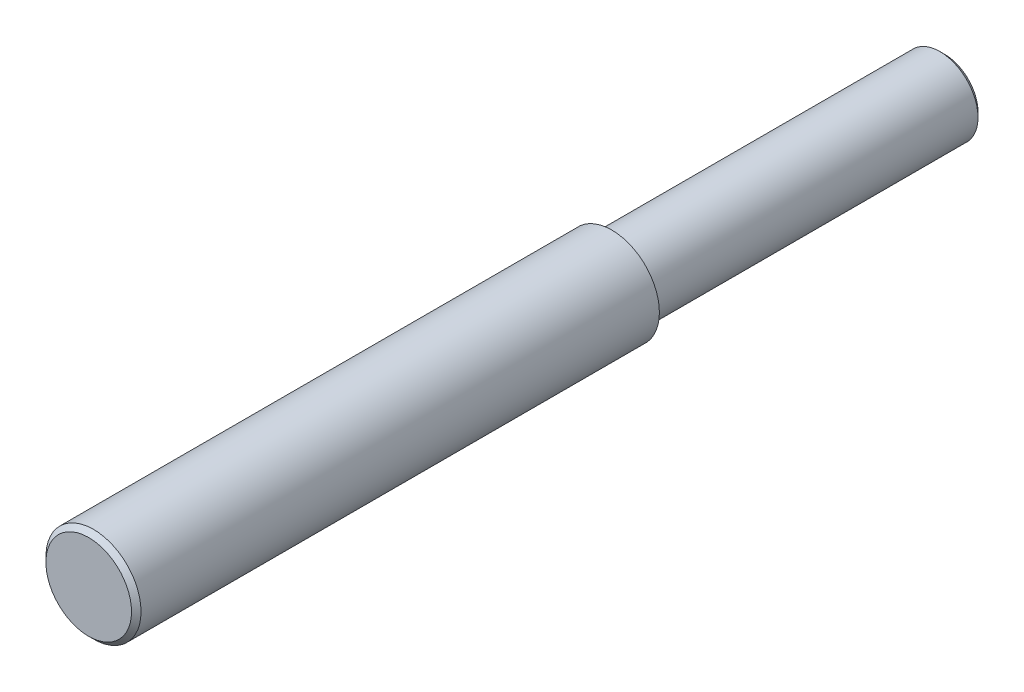
ISO-10303-21;
HEADER;
FILE_DESCRIPTION(('STEP AP214'),'2;1');
FILE_NAME('part.step','',(''),(''),'','','');
FILE_SCHEMA(('AUTOMOTIVE_DESIGN { 1 0 10303 214 1 1 1 1 }'));
ENDSEC;
DATA;
#1=APPLICATION_CONTEXT('core data for automotive mechanical design processes');
#2=APPLICATION_PROTOCOL_DEFINITION('international standard','automotive_design',2000,#1);
#3=PRODUCT_CONTEXT('',#1,'mechanical');
#4=PRODUCT('Part','Part','',(#3));
#5=PRODUCT_RELATED_PRODUCT_CATEGORY('part','',(#4));
#6=PRODUCT_DEFINITION_FORMATION('','',#4);
#7=PRODUCT_DEFINITION_CONTEXT('part definition',#1,'design');
#8=PRODUCT_DEFINITION('design','',#6,#7);
#9=PRODUCT_DEFINITION_SHAPE('','',#8);
#10=(LENGTH_UNIT() NAMED_UNIT(*) SI_UNIT(.MILLI.,.METRE.));
#11=(NAMED_UNIT(*) PLANE_ANGLE_UNIT() SI_UNIT($,.RADIAN.));
#12=(NAMED_UNIT(*) SI_UNIT($,.STERADIAN.) SOLID_ANGLE_UNIT());
#13=UNCERTAINTY_MEASURE_WITH_UNIT(LENGTH_MEASURE(1.E-05),#10,'distance_accuracy_value','');
#14=(GEOMETRIC_REPRESENTATION_CONTEXT(3) GLOBAL_UNCERTAINTY_ASSIGNED_CONTEXT((#13)) GLOBAL_UNIT_ASSIGNED_CONTEXT((#10,
#11,#12)) REPRESENTATION_CONTEXT('',''));
#15=CARTESIAN_POINT('',(0.,0.,0.));
#16=DIRECTION('',(0.,0.,1.));
#17=DIRECTION('',(1.,0.,0.));
#18=AXIS2_PLACEMENT_3D('',#15,#16,#17);
#19=CARTESIAN_POINT('',(0.,0.,-18.));
#20=DIRECTION('',(0.,0.,1.));
#21=DIRECTION('',(1.,0.,0.));
#22=AXIS2_PLACEMENT_3D('',#19,#20,#21);
#23=CYLINDRICAL_SURFACE('',#22,1.);
#24=CARTESIAN_POINT('',(0.,0.,-0.100000000000003));
#25=DIRECTION('',(0.,0.,1.));
#26=DIRECTION('',(1.,0.,0.));
#27=AXIS2_PLACEMENT_3D('',#24,#25,#26);
#28=CIRCLE('',#27,1.);
#29=CARTESIAN_POINT('',(1.,0.,-0.100000000000003));
#30=VERTEX_POINT('',#29);
#31=EDGE_CURVE('E11',#30,#30,#28,.F.);
#32=ORIENTED_EDGE('',*,*,#31,.T.);
#33=EDGE_LOOP('',(#32));
#34=FACE_BOUND('',#33,.T.);
#35=CARTESIAN_POINT('',(0.,0.,-11.));
#36=DIRECTION('',(0.,0.,-1.));
#37=DIRECTION('',(-1.,0.,0.));
#38=AXIS2_PLACEMENT_3D('',#35,#36,#37);
#39=CIRCLE('',#38,1.);
#40=CARTESIAN_POINT('',(-1.,0.,-11.));
#41=VERTEX_POINT('',#40);
#42=EDGE_CURVE('E53',#41,#41,#39,.F.);
#43=ORIENTED_EDGE('',*,*,#42,.T.);
#44=EDGE_LOOP('',(#43));
#45=FACE_BOUND('',#44,.T.);
#46=ADVANCED_FACE('F33',(#34,#45),#23,.T.);
#47=CARTESIAN_POINT('',(0.,0.,0.));
#48=DIRECTION('',(0.,0.,1.));
#49=DIRECTION('',(1.,0.,0.));
#50=AXIS2_PLACEMENT_3D('',#47,#48,#49);
#51=PLANE('',#50);
#52=CARTESIAN_POINT('',(0.,0.,0.));
#53=DIRECTION('',(0.,0.,1.));
#54=DIRECTION('',(1.,0.,0.));
#55=AXIS2_PLACEMENT_3D('',#52,#53,#54);
#56=CIRCLE('',#55,0.899999999999998);
#57=CARTESIAN_POINT('',(0.899999999999998,0.,0.));
#58=VERTEX_POINT('',#57);
#59=EDGE_CURVE('E40',#58,#58,#56,.T.);
#60=ORIENTED_EDGE('',*,*,#59,.T.);
#61=EDGE_LOOP('',(#60));
#62=FACE_BOUND('',#61,.T.);
#63=ADVANCED_FACE('F64',(#62),#51,.T.);
#64=CARTESIAN_POINT('',(0.,0.,-11.));
#65=DIRECTION('',(0.,0.,-1.));
#66=DIRECTION('',(-1.,0.,0.));
#67=AXIS2_PLACEMENT_3D('',#64,#65,#66);
#68=PLANE('',#67);
#69=ORIENTED_EDGE('',*,*,#42,.F.);
#70=EDGE_LOOP('',(#69));
#71=FACE_BOUND('',#70,.T.);
#72=CARTESIAN_POINT('',(0.,0.,-11.));
#73=DIRECTION('',(0.,0.,-1.));
#74=DIRECTION('',(-1.,0.,0.));
#75=AXIS2_PLACEMENT_3D('',#72,#73,#74);
#76=CIRCLE('',#75,0.8);
#77=CARTESIAN_POINT('',(-0.8,0.,-11.));
#78=VERTEX_POINT('',#77);
#79=EDGE_CURVE('E56',#78,#78,#76,.T.);
#80=ORIENTED_EDGE('',*,*,#79,.F.);
#81=EDGE_LOOP('',(#80));
#82=FACE_BOUND('',#81,.T.);
#83=ADVANCED_FACE('F62',(#71,#82),#68,.T.);
#84=CARTESIAN_POINT('',(0.,0.,-11.));
#85=DIRECTION('',(0.,0.,-1.));
#86=DIRECTION('',(-1.,0.,0.));
#87=AXIS2_PLACEMENT_3D('',#84,#85,#86);
#88=CYLINDRICAL_SURFACE('',#87,0.8);
#89=CARTESIAN_POINT('',(0.,0.,-17.9));
#90=DIRECTION('',(0.,0.,1.));
#91=DIRECTION('',(1.,0.,0.));
#92=AXIS2_PLACEMENT_3D('',#89,#90,#91);
#93=CIRCLE('',#92,0.8);
#94=CARTESIAN_POINT('',(0.8,0.,-17.9));
#95=VERTEX_POINT('',#94);
#96=EDGE_CURVE('E44',#95,#95,#93,.T.);
#97=ORIENTED_EDGE('',*,*,#96,.T.);
#98=EDGE_LOOP('',(#97));
#99=FACE_BOUND('',#98,.T.);
#100=ORIENTED_EDGE('',*,*,#79,.T.);
#101=EDGE_LOOP('',(#100));
#102=FACE_BOUND('',#101,.T.);
#103=ADVANCED_FACE('F60',(#99,#102),#88,.T.);
#104=CARTESIAN_POINT('',(0.,0.,-18.));
#105=DIRECTION('',(0.,0.,1.));
#106=DIRECTION('',(1.,0.,0.));
#107=AXIS2_PLACEMENT_3D('',#104,#105,#106);
#108=PLANE('',#107);
#109=CARTESIAN_POINT('',(0.,0.,-18.));
#110=DIRECTION('',(0.,0.,1.));
#111=DIRECTION('',(1.,0.,0.));
#112=AXIS2_PLACEMENT_3D('',#109,#110,#111);
#113=CIRCLE('',#112,0.700000000000004);
#114=CARTESIAN_POINT('',(0.700000000000004,0.,-18.));
#115=VERTEX_POINT('',#114);
#116=EDGE_CURVE('E48',#115,#115,#113,.F.);
#117=ORIENTED_EDGE('',*,*,#116,.T.);
#118=EDGE_LOOP('',(#117));
#119=FACE_BOUND('',#118,.T.);
#120=ADVANCED_FACE('F71',(#119),#108,.F.);
#121=CARTESIAN_POINT('',(0.,0.,-18.));
#122=DIRECTION('',(0.,0.,1.));
#123=DIRECTION('',(1.,0.,0.));
#124=AXIS2_PLACEMENT_3D('',#121,#122,#123);
#125=CONICAL_SURFACE('',#124,0.700000000000004,0.785398163397464);
#126=ORIENTED_EDGE('',*,*,#96,.F.);
#127=EDGE_LOOP('',(#126));
#128=FACE_BOUND('',#127,.T.);
#129=ORIENTED_EDGE('',*,*,#116,.F.);
#130=EDGE_LOOP('',(#129));
#131=FACE_BOUND('',#130,.T.);
#132=ADVANCED_FACE('F82',(#128,#131),#125,.T.);
#133=CARTESIAN_POINT('',(0.,0.,0.));
#134=DIRECTION('',(0.,0.,-1.));
#135=DIRECTION('',(-1.,0.,0.));
#136=AXIS2_PLACEMENT_3D('',#133,#134,#135);
#137=CONICAL_SURFACE('',#136,0.899999999999998,0.785398163397444);
#138=ORIENTED_EDGE('',*,*,#31,.F.);
#139=EDGE_LOOP('',(#138));
#140=FACE_BOUND('',#139,.T.);
#141=ORIENTED_EDGE('',*,*,#59,.F.);
#142=EDGE_LOOP('',(#141));
#143=FACE_BOUND('',#142,.T.);
#144=ADVANCED_FACE('F35',(#140,#143),#137,.T.);
#145=CLOSED_SHELL('',(#46,#63,#83,#103,#120,#132,#144));
#146=MANIFOLD_SOLID_BREP('B2',#145);
#147=ADVANCED_BREP_SHAPE_REPRESENTATION('',(#18,#146),#14);
#148=SHAPE_DEFINITION_REPRESENTATION(#9,#147);
ENDSEC;
END-ISO-10303-21;
